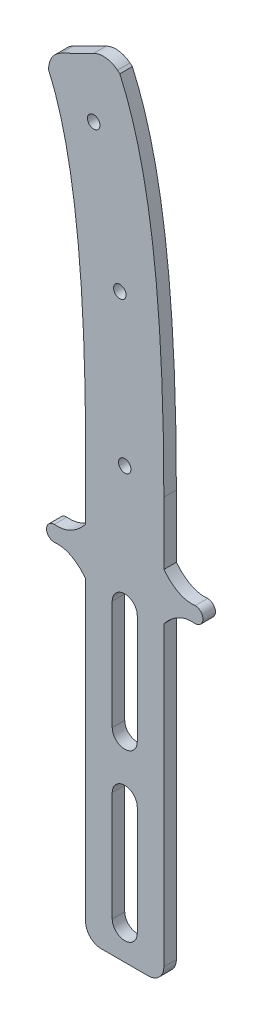
ISO-10303-21;
HEADER;
FILE_DESCRIPTION(('STEP AP214'),'2;1');
FILE_NAME('part.step','',(''),(''),'','','');
FILE_SCHEMA(('AUTOMOTIVE_DESIGN { 1 0 10303 214 1 1 1 1 }'));
ENDSEC;
DATA;
#1=APPLICATION_CONTEXT('core data for automotive mechanical design processes');
#2=APPLICATION_PROTOCOL_DEFINITION('international standard','automotive_design',2000,#1);
#3=PRODUCT_CONTEXT('',#1,'mechanical');
#4=PRODUCT('Part','Part','',(#3));
#5=PRODUCT_RELATED_PRODUCT_CATEGORY('part','',(#4));
#6=PRODUCT_DEFINITION_FORMATION('','',#4);
#7=PRODUCT_DEFINITION_CONTEXT('part definition',#1,'design');
#8=PRODUCT_DEFINITION('design','',#6,#7);
#9=PRODUCT_DEFINITION_SHAPE('','',#8);
#10=(LENGTH_UNIT() NAMED_UNIT(*) SI_UNIT(.MILLI.,.METRE.));
#11=(NAMED_UNIT(*) PLANE_ANGLE_UNIT() SI_UNIT($,.RADIAN.));
#12=(NAMED_UNIT(*) SI_UNIT($,.STERADIAN.) SOLID_ANGLE_UNIT());
#13=UNCERTAINTY_MEASURE_WITH_UNIT(LENGTH_MEASURE(1.E-05),#10,'distance_accuracy_value','');
#14=(GEOMETRIC_REPRESENTATION_CONTEXT(3) GLOBAL_UNCERTAINTY_ASSIGNED_CONTEXT((#13)) GLOBAL_UNIT_ASSIGNED_CONTEXT((#10,
#11,#12)) REPRESENTATION_CONTEXT('',''));
#15=CARTESIAN_POINT('',(0.,0.,0.));
#16=DIRECTION('',(0.,0.,1.));
#17=DIRECTION('',(1.,0.,0.));
#18=AXIS2_PLACEMENT_3D('',#15,#16,#17);
#19=CARTESIAN_POINT('',(12.4999999999998,78.,4.));
#20=DIRECTION('',(0.,0.,-1.));
#21=DIRECTION('',(-1.,0.,0.));
#22=AXIS2_PLACEMENT_3D('',#19,#20,#21);
#23=CYLINDRICAL_SURFACE('',#22,4.);
#24=CARTESIAN_POINT('',(12.4999999999998,78.,0.));
#25=DIRECTION('',(0.,0.,1.));
#26=DIRECTION('',(1.,0.,0.));
#27=AXIS2_PLACEMENT_3D('',#24,#25,#26);
#28=CIRCLE('',#27,4.);
#29=CARTESIAN_POINT('',(16.4999999999998,78.,0.));
#30=VERTEX_POINT('',#29);
#31=CARTESIAN_POINT('',(8.49999999999982,78.,0.));
#32=VERTEX_POINT('',#31);
#33=EDGE_CURVE('E398',#30,#32,#28,.T.);
#34=ORIENTED_EDGE('',*,*,#33,.F.);
#35=DIRECTION('',(0.,0.,-1.));
#36=VECTOR('',#35,1.);
#37=CARTESIAN_POINT('',(16.4999999999998,78.,4.));
#38=LINE('',#37,#36);
#39=CARTESIAN_POINT('',(16.4999999999998,78.,4.));
#40=VERTEX_POINT('',#39);
#41=EDGE_CURVE('E11',#40,#30,#38,.T.);
#42=ORIENTED_EDGE('',*,*,#41,.F.);
#43=CARTESIAN_POINT('',(12.4999999999998,78.,4.));
#44=DIRECTION('',(0.,0.,1.));
#45=DIRECTION('',(1.,0.,0.));
#46=AXIS2_PLACEMENT_3D('',#43,#44,#45);
#47=CIRCLE('',#46,4.);
#48=CARTESIAN_POINT('',(8.49999999999982,78.,4.));
#49=VERTEX_POINT('',#48);
#50=EDGE_CURVE('E254',#40,#49,#47,.T.);
#51=ORIENTED_EDGE('',*,*,#50,.T.);
#52=DIRECTION('',(0.,0.,-1.));
#53=VECTOR('',#52,1.);
#54=CARTESIAN_POINT('',(8.49999999999982,78.,4.));
#55=LINE('',#54,#53);
#56=EDGE_CURVE('E156',#49,#32,#55,.T.);
#57=ORIENTED_EDGE('',*,*,#56,.T.);
#58=EDGE_LOOP('',(#34,#42,#51,#57));
#59=FACE_BOUND('',#58,.T.);
#60=ADVANCED_FACE('F41',(#59),#23,.F.);
#61=CARTESIAN_POINT('',(16.4999999999998,0.,4.));
#62=DIRECTION('',(-1.,0.,0.));
#63=DIRECTION('',(0.,0.,1.));
#64=AXIS2_PLACEMENT_3D('',#61,#62,#63);
#65=PLANE('',#64);
#66=DIRECTION('',(0.,1.,0.));
#67=VECTOR('',#66,1.);
#68=CARTESIAN_POINT('',(16.4999999999998,0.,0.));
#69=LINE('',#68,#67);
#70=CARTESIAN_POINT('',(16.4999999999998,43.,0.));
#71=VERTEX_POINT('',#70);
#72=EDGE_CURVE('E244',#71,#30,#69,.T.);
#73=ORIENTED_EDGE('',*,*,#72,.F.);
#74=DIRECTION('',(0.,0.,-1.));
#75=VECTOR('',#74,1.);
#76=CARTESIAN_POINT('',(16.4999999999998,43.,4.));
#77=LINE('',#76,#75);
#78=CARTESIAN_POINT('',(16.4999999999998,43.,4.));
#79=VERTEX_POINT('',#78);
#80=EDGE_CURVE('E53',#79,#71,#77,.T.);
#81=ORIENTED_EDGE('',*,*,#80,.F.);
#82=DIRECTION('',(0.,1.,0.));
#83=VECTOR('',#82,1.);
#84=CARTESIAN_POINT('',(16.4999999999998,0.,4.));
#85=LINE('',#84,#83);
#86=EDGE_CURVE('E242',#79,#40,#85,.T.);
#87=ORIENTED_EDGE('',*,*,#86,.T.);
#88=ORIENTED_EDGE('',*,*,#41,.T.);
#89=EDGE_LOOP('',(#73,#81,#87,#88));
#90=FACE_BOUND('',#89,.T.);
#91=ADVANCED_FACE('F241',(#90),#65,.T.);
#92=CARTESIAN_POINT('',(12.4999999999998,43.,4.));
#93=DIRECTION('',(0.,0.,-1.));
#94=DIRECTION('',(-1.,0.,0.));
#95=AXIS2_PLACEMENT_3D('',#92,#93,#94);
#96=CYLINDRICAL_SURFACE('',#95,4.);
#97=CARTESIAN_POINT('',(12.4999999999998,43.,0.));
#98=DIRECTION('',(0.,0.,1.));
#99=DIRECTION('',(1.,0.,0.));
#100=AXIS2_PLACEMENT_3D('',#97,#98,#99);
#101=CIRCLE('',#100,4.);
#102=CARTESIAN_POINT('',(8.49999999999982,43.,0.));
#103=VERTEX_POINT('',#102);
#104=EDGE_CURVE('E404',#103,#71,#101,.T.);
#105=ORIENTED_EDGE('',*,*,#104,.F.);
#106=DIRECTION('',(0.,0.,-1.));
#107=VECTOR('',#106,1.);
#108=CARTESIAN_POINT('',(8.49999999999982,43.,4.));
#109=LINE('',#108,#107);
#110=CARTESIAN_POINT('',(8.49999999999982,43.,4.));
#111=VERTEX_POINT('',#110);
#112=EDGE_CURVE('E149',#111,#103,#109,.T.);
#113=ORIENTED_EDGE('',*,*,#112,.F.);
#114=CARTESIAN_POINT('',(12.4999999999998,43.,4.));
#115=DIRECTION('',(0.,0.,1.));
#116=DIRECTION('',(1.,0.,0.));
#117=AXIS2_PLACEMENT_3D('',#114,#115,#116);
#118=CIRCLE('',#117,4.);
#119=EDGE_CURVE('E253',#111,#79,#118,.T.);
#120=ORIENTED_EDGE('',*,*,#119,.T.);
#121=ORIENTED_EDGE('',*,*,#80,.T.);
#122=EDGE_LOOP('',(#105,#113,#120,#121));
#123=FACE_BOUND('',#122,.T.);
#124=ADVANCED_FACE('F257',(#123),#96,.F.);
#125=CARTESIAN_POINT('',(12.5,25.,4.));
#126=DIRECTION('',(0.,0.,-1.));
#127=DIRECTION('',(-1.,0.,0.));
#128=AXIS2_PLACEMENT_3D('',#125,#126,#127);
#129=CYLINDRICAL_SURFACE('',#128,4.);
#130=CARTESIAN_POINT('',(12.5,25.,0.));
#131=DIRECTION('',(0.,0.,1.));
#132=DIRECTION('',(1.,0.,0.));
#133=AXIS2_PLACEMENT_3D('',#130,#131,#132);
#134=CIRCLE('',#133,4.);
#135=CARTESIAN_POINT('',(16.5,25.,0.));
#136=VERTEX_POINT('',#135);
#137=CARTESIAN_POINT('',(8.5,25.,0.));
#138=VERTEX_POINT('',#137);
#139=EDGE_CURVE('E382',#136,#138,#134,.T.);
#140=ORIENTED_EDGE('',*,*,#139,.F.);
#141=DIRECTION('',(0.,0.,-1.));
#142=VECTOR('',#141,1.);
#143=CARTESIAN_POINT('',(16.5,25.,4.));
#144=LINE('',#143,#142);
#145=CARTESIAN_POINT('',(16.5,25.,4.));
#146=VERTEX_POINT('',#145);
#147=EDGE_CURVE('E425',#146,#136,#144,.T.);
#148=ORIENTED_EDGE('',*,*,#147,.F.);
#149=CARTESIAN_POINT('',(12.5,25.,4.));
#150=DIRECTION('',(0.,0.,1.));
#151=DIRECTION('',(1.,0.,0.));
#152=AXIS2_PLACEMENT_3D('',#149,#150,#151);
#153=CIRCLE('',#152,4.);
#154=CARTESIAN_POINT('',(8.5,25.,4.));
#155=VERTEX_POINT('',#154);
#156=EDGE_CURVE('E644',#146,#155,#153,.T.);
#157=ORIENTED_EDGE('',*,*,#156,.T.);
#158=DIRECTION('',(0.,0.,-1.));
#159=VECTOR('',#158,1.);
#160=CARTESIAN_POINT('',(8.5,25.,4.));
#161=LINE('',#160,#159);
#162=EDGE_CURVE('E428',#155,#138,#161,.T.);
#163=ORIENTED_EDGE('',*,*,#162,.T.);
#164=EDGE_LOOP('',(#140,#148,#157,#163));
#165=FACE_BOUND('',#164,.T.);
#166=ADVANCED_FACE('F611',(#165),#129,.F.);
#167=CARTESIAN_POINT('',(16.5,0.,4.));
#168=DIRECTION('',(-1.,0.,0.));
#169=DIRECTION('',(0.,0.,1.));
#170=AXIS2_PLACEMENT_3D('',#167,#168,#169);
#171=PLANE('',#170);
#172=DIRECTION('',(0.,1.,0.));
#173=VECTOR('',#172,1.);
#174=CARTESIAN_POINT('',(16.5,0.,0.));
#175=LINE('',#174,#173);
#176=CARTESIAN_POINT('',(16.5,-9.99999999999999,0.));
#177=VERTEX_POINT('',#176);
#178=EDGE_CURVE('E386',#177,#136,#175,.T.);
#179=ORIENTED_EDGE('',*,*,#178,.F.);
#180=DIRECTION('',(0.,0.,-1.));
#181=VECTOR('',#180,1.);
#182=CARTESIAN_POINT('',(16.5,-9.99999999999999,4.));
#183=LINE('',#182,#181);
#184=CARTESIAN_POINT('',(16.5,-9.99999999999999,4.));
#185=VERTEX_POINT('',#184);
#186=EDGE_CURVE('E434',#185,#177,#183,.T.);
#187=ORIENTED_EDGE('',*,*,#186,.F.);
#188=DIRECTION('',(0.,1.,0.));
#189=VECTOR('',#188,1.);
#190=CARTESIAN_POINT('',(16.5,0.,4.));
#191=LINE('',#190,#189);
#192=EDGE_CURVE('E648',#185,#146,#191,.T.);
#193=ORIENTED_EDGE('',*,*,#192,.T.);
#194=ORIENTED_EDGE('',*,*,#147,.T.);
#195=EDGE_LOOP('',(#179,#187,#193,#194));
#196=FACE_BOUND('',#195,.T.);
#197=ADVANCED_FACE('F607',(#196),#171,.T.);
#198=CARTESIAN_POINT('',(12.5,-9.99999999999999,4.));
#199=DIRECTION('',(0.,0.,-1.));
#200=DIRECTION('',(-1.,0.,0.));
#201=AXIS2_PLACEMENT_3D('',#198,#199,#200);
#202=CYLINDRICAL_SURFACE('',#201,4.);
#203=CARTESIAN_POINT('',(12.5,-9.99999999999999,0.));
#204=DIRECTION('',(0.,0.,1.));
#205=DIRECTION('',(1.,0.,0.));
#206=AXIS2_PLACEMENT_3D('',#203,#204,#205);
#207=CIRCLE('',#206,4.);
#208=CARTESIAN_POINT('',(8.5,-9.99999999999999,0.));
#209=VERTEX_POINT('',#208);
#210=EDGE_CURVE('E390',#209,#177,#207,.T.);
#211=ORIENTED_EDGE('',*,*,#210,.F.);
#212=DIRECTION('',(0.,0.,-1.));
#213=VECTOR('',#212,1.);
#214=CARTESIAN_POINT('',(8.5,-9.99999999999999,4.));
#215=LINE('',#214,#213);
#216=CARTESIAN_POINT('',(8.5,-9.99999999999999,4.));
#217=VERTEX_POINT('',#216);
#218=EDGE_CURVE('E431',#217,#209,#215,.T.);
#219=ORIENTED_EDGE('',*,*,#218,.F.);
#220=CARTESIAN_POINT('',(12.5,-9.99999999999999,4.));
#221=DIRECTION('',(0.,0.,1.));
#222=DIRECTION('',(1.,0.,0.));
#223=AXIS2_PLACEMENT_3D('',#220,#221,#222);
#224=CIRCLE('',#223,4.);
#225=EDGE_CURVE('E652',#217,#185,#224,.T.);
#226=ORIENTED_EDGE('',*,*,#225,.T.);
#227=ORIENTED_EDGE('',*,*,#186,.T.);
#228=EDGE_LOOP('',(#211,#219,#226,#227));
#229=FACE_BOUND('',#228,.T.);
#230=ADVANCED_FACE('F590',(#229),#202,.F.);
#231=CARTESIAN_POINT('',(0.,95.,4.));
#232=CARTESIAN_POINT('',(-4.58006982322337,89.4182050227499,4.));
#233=CARTESIAN_POINT('',(-10.,90.,4.));
#234=B_SPLINE_CURVE_WITH_KNOTS('',2,(#231,#232,#233),.UNSPECIFIED.,.F.,.F.,(3,3),(0.,1.),.UNSPECIFIED.);
#235=DIRECTION('',(0.,0.,-1.));
#236=VECTOR('',#235,1.);
#237=SURFACE_OF_LINEAR_EXTRUSION('',#234,#236);
#238=CARTESIAN_POINT('',(0.,95.,0.));
#239=CARTESIAN_POINT('',(-4.58006982322337,89.4182050227499,0.));
#240=CARTESIAN_POINT('',(-10.,90.,0.));
#241=B_SPLINE_CURVE_WITH_KNOTS('',2,(#238,#239,#240),.UNSPECIFIED.,.F.,.F.,(3,3),(0.,1.),.UNSPECIFIED.);
#242=CARTESIAN_POINT('',(0.,95.,0.));
#243=VERTEX_POINT('',#242);
#244=CARTESIAN_POINT('',(-10.,90.,0.));
#245=VERTEX_POINT('',#244);
#246=EDGE_CURVE('E277',#243,#245,#241,.T.);
#247=ORIENTED_EDGE('',*,*,#246,.T.);
#248=DIRECTION('',(0.,0.,-1.));
#249=VECTOR('',#248,1.);
#250=CARTESIAN_POINT('',(-10.,90.,4.));
#251=LINE('',#250,#249);
#252=CARTESIAN_POINT('',(-10.,90.,4.));
#253=VERTEX_POINT('',#252);
#254=EDGE_CURVE('E46',#253,#245,#251,.T.);
#255=ORIENTED_EDGE('',*,*,#254,.F.);
#256=CARTESIAN_POINT('',(0.,95.,4.));
#257=VERTEX_POINT('',#256);
#258=EDGE_CURVE('E422',#257,#253,#234,.T.);
#259=ORIENTED_EDGE('',*,*,#258,.F.);
#260=DIRECTION('',(0.,0.,-1.));
#261=VECTOR('',#260,1.);
#262=CARTESIAN_POINT('',(0.,95.,4.));
#263=LINE('',#262,#261);
#264=EDGE_CURVE('E276',#257,#243,#263,.T.);
#265=ORIENTED_EDGE('',*,*,#264,.T.);
#266=EDGE_LOOP('',(#247,#255,#259,#265));
#267=FACE_BOUND('',#266,.T.);
#268=ADVANCED_FACE('F43',(#267),#237,.F.);
#269=CARTESIAN_POINT('',(-10.,87.5,4.));
#270=DIRECTION('',(0.,0.,-1.));
#271=DIRECTION('',(-1.,0.,0.));
#272=AXIS2_PLACEMENT_3D('',#269,#270,#271);
#273=CYLINDRICAL_SURFACE('',#272,2.5);
#274=CARTESIAN_POINT('',(-10.,87.5,0.));
#275=DIRECTION('',(0.,0.,1.));
#276=DIRECTION('',(1.,0.,0.));
#277=AXIS2_PLACEMENT_3D('',#274,#275,#276);
#278=CIRCLE('',#277,2.5);
#279=CARTESIAN_POINT('',(-10.,85.,0.));
#280=VERTEX_POINT('',#279);
#281=EDGE_CURVE('E283',#245,#280,#278,.T.);
#282=ORIENTED_EDGE('',*,*,#281,.T.);
#283=DIRECTION('',(0.,0.,-1.));
#284=VECTOR('',#283,1.);
#285=CARTESIAN_POINT('',(-10.,85.,4.));
#286=LINE('',#285,#284);
#287=CARTESIAN_POINT('',(-10.,85.,4.));
#288=VERTEX_POINT('',#287);
#289=EDGE_CURVE('E496',#288,#280,#286,.T.);
#290=ORIENTED_EDGE('',*,*,#289,.F.);
#291=CARTESIAN_POINT('',(-10.,87.5,4.));
#292=DIRECTION('',(0.,0.,1.));
#293=DIRECTION('',(1.,0.,0.));
#294=AXIS2_PLACEMENT_3D('',#291,#292,#293);
#295=CIRCLE('',#294,2.5);
#296=EDGE_CURVE('E164',#253,#288,#295,.T.);
#297=ORIENTED_EDGE('',*,*,#296,.F.);
#298=ORIENTED_EDGE('',*,*,#254,.T.);
#299=EDGE_LOOP('',(#282,#290,#297,#298));
#300=FACE_BOUND('',#299,.T.);
#301=ADVANCED_FACE('F503',(#300),#273,.T.);
#302=CARTESIAN_POINT('',(0.,80.,4.));
#303=CARTESIAN_POINT('',(-4.58006982322337,85.5817949772501,4.));
#304=CARTESIAN_POINT('',(-10.,85.,4.));
#305=B_SPLINE_CURVE_WITH_KNOTS('',2,(#302,#303,#304),.UNSPECIFIED.,.F.,.F.,(3,3),(0.,1.),.UNSPECIFIED.);
#306=DIRECTION('',(0.,0.,-1.));
#307=VECTOR('',#306,1.);
#308=SURFACE_OF_LINEAR_EXTRUSION('',#305,#307);
#309=CARTESIAN_POINT('',(0.,80.,0.));
#310=CARTESIAN_POINT('',(-4.58006982322337,85.5817949772501,0.));
#311=CARTESIAN_POINT('',(-10.,85.,0.));
#312=B_SPLINE_CURVE_WITH_KNOTS('',2,(#309,#310,#311),.UNSPECIFIED.,.F.,.F.,(3,3),(0.,1.),.UNSPECIFIED.);
#313=CARTESIAN_POINT('',(0.,80.,0.));
#314=VERTEX_POINT('',#313);
#315=EDGE_CURVE('E290',#314,#280,#312,.T.);
#316=ORIENTED_EDGE('',*,*,#315,.F.);
#317=DIRECTION('',(0.,0.,-1.));
#318=VECTOR('',#317,1.);
#319=CARTESIAN_POINT('',(0.,80.,4.));
#320=LINE('',#319,#318);
#321=CARTESIAN_POINT('',(0.,80.,4.));
#322=VERTEX_POINT('',#321);
#323=EDGE_CURVE('E494',#322,#314,#320,.T.);
#324=ORIENTED_EDGE('',*,*,#323,.F.);
#325=EDGE_CURVE('E517',#322,#288,#305,.T.);
#326=ORIENTED_EDGE('',*,*,#325,.T.);
#327=ORIENTED_EDGE('',*,*,#289,.T.);
#328=EDGE_LOOP('',(#316,#324,#326,#327));
#329=FACE_BOUND('',#328,.T.);
#330=ADVANCED_FACE('F515',(#329),#308,.T.);
#331=CARTESIAN_POINT('',(0.,0.,4.));
#332=DIRECTION('',(-1.,0.,0.));
#333=DIRECTION('',(0.,0.,1.));
#334=AXIS2_PLACEMENT_3D('',#331,#332,#333);
#335=PLANE('',#334);
#336=DIRECTION('',(0.,1.,0.));
#337=VECTOR('',#336,1.);
#338=CARTESIAN_POINT('',(0.,0.,0.));
#339=LINE('',#338,#337);
#340=CARTESIAN_POINT('',(0.,-15.,0.));
#341=VERTEX_POINT('',#340);
#342=EDGE_CURVE('E296',#341,#314,#339,.T.);
#343=ORIENTED_EDGE('',*,*,#342,.F.);
#344=DIRECTION('',(0.,0.,-1.));
#345=VECTOR('',#344,1.);
#346=CARTESIAN_POINT('',(0.,-15.,4.));
#347=LINE('',#346,#345);
#348=CARTESIAN_POINT('',(0.,-15.,4.));
#349=VERTEX_POINT('',#348);
#350=EDGE_CURVE('E491',#349,#341,#347,.T.);
#351=ORIENTED_EDGE('',*,*,#350,.F.);
#352=DIRECTION('',(0.,1.,0.));
#353=VECTOR('',#352,1.);
#354=CARTESIAN_POINT('',(0.,0.,4.));
#355=LINE('',#354,#353);
#356=EDGE_CURVE('E523',#349,#322,#355,.T.);
#357=ORIENTED_EDGE('',*,*,#356,.T.);
#358=ORIENTED_EDGE('',*,*,#323,.T.);
#359=EDGE_LOOP('',(#343,#351,#357,#358));
#360=FACE_BOUND('',#359,.T.);
#361=ADVANCED_FACE('F526',(#360),#335,.T.);
#362=CARTESIAN_POINT('',(5.,-15.,4.));
#363=DIRECTION('',(0.,0.,-1.));
#364=DIRECTION('',(-1.,0.,0.));
#365=AXIS2_PLACEMENT_3D('',#362,#363,#364);
#366=CYLINDRICAL_SURFACE('',#365,5.);
#367=CARTESIAN_POINT('',(5.,-15.,0.));
#368=DIRECTION('',(0.,0.,1.));
#369=DIRECTION('',(1.,0.,0.));
#370=AXIS2_PLACEMENT_3D('',#367,#368,#369);
#371=CIRCLE('',#370,5.);
#372=CARTESIAN_POINT('',(5.00000000000004,-20.,0.));
#373=VERTEX_POINT('',#372);
#374=EDGE_CURVE('E303',#341,#373,#371,.T.);
#375=ORIENTED_EDGE('',*,*,#374,.T.);
#376=DIRECTION('',(0.,0.,-1.));
#377=VECTOR('',#376,1.);
#378=CARTESIAN_POINT('',(5.00000000000004,-20.,4.));
#379=LINE('',#378,#377);
#380=CARTESIAN_POINT('',(5.00000000000004,-20.,4.));
#381=VERTEX_POINT('',#380);
#382=EDGE_CURVE('E487',#381,#373,#379,.T.);
#383=ORIENTED_EDGE('',*,*,#382,.F.);
#384=CARTESIAN_POINT('',(5.,-15.,4.));
#385=DIRECTION('',(0.,0.,1.));
#386=DIRECTION('',(1.,0.,0.));
#387=AXIS2_PLACEMENT_3D('',#384,#385,#386);
#388=CIRCLE('',#387,5.);
#389=EDGE_CURVE('E529',#349,#381,#388,.T.);
#390=ORIENTED_EDGE('',*,*,#389,.F.);
#391=ORIENTED_EDGE('',*,*,#350,.T.);
#392=EDGE_LOOP('',(#375,#383,#390,#391));
#393=FACE_BOUND('',#392,.T.);
#394=ADVANCED_FACE('F578',(#393),#366,.T.);
#395=CARTESIAN_POINT('',(0.,-20.,4.));
#396=DIRECTION('',(0.,1.,0.));
#397=DIRECTION('',(0.,0.,1.));
#398=AXIS2_PLACEMENT_3D('',#395,#396,#397);
#399=PLANE('',#398);
#400=DIRECTION('',(1.,0.,0.));
#401=VECTOR('',#400,1.);
#402=CARTESIAN_POINT('',(0.,-20.,0.));
#403=LINE('',#402,#401);
#404=CARTESIAN_POINT('',(20.,-20.,0.));
#405=VERTEX_POINT('',#404);
#406=EDGE_CURVE('E306',#373,#405,#403,.T.);
#407=ORIENTED_EDGE('',*,*,#406,.T.);
#408=DIRECTION('',(0.,0.,-1.));
#409=VECTOR('',#408,1.);
#410=CARTESIAN_POINT('',(20.,-20.,4.));
#411=LINE('',#410,#409);
#412=CARTESIAN_POINT('',(20.,-20.,4.));
#413=VERTEX_POINT('',#412);
#414=EDGE_CURVE('E483',#413,#405,#411,.T.);
#415=ORIENTED_EDGE('',*,*,#414,.F.);
#416=DIRECTION('',(1.,0.,0.));
#417=VECTOR('',#416,1.);
#418=CARTESIAN_POINT('',(0.,-20.,4.));
#419=LINE('',#418,#417);
#420=EDGE_CURVE('E532',#381,#413,#419,.T.);
#421=ORIENTED_EDGE('',*,*,#420,.F.);
#422=ORIENTED_EDGE('',*,*,#382,.T.);
#423=EDGE_LOOP('',(#407,#415,#421,#422));
#424=FACE_BOUND('',#423,.T.);
#425=ADVANCED_FACE('F574',(#424),#399,.F.);
#426=CARTESIAN_POINT('',(20.,-15.,4.));
#427=DIRECTION('',(0.,0.,-1.));
#428=DIRECTION('',(-1.,0.,0.));
#429=AXIS2_PLACEMENT_3D('',#426,#427,#428);
#430=CYLINDRICAL_SURFACE('',#429,5.);
#431=CARTESIAN_POINT('',(20.,-15.,0.));
#432=DIRECTION('',(0.,0.,1.));
#433=DIRECTION('',(1.,0.,0.));
#434=AXIS2_PLACEMENT_3D('',#431,#432,#433);
#435=CIRCLE('',#434,5.);
#436=CARTESIAN_POINT('',(25.,-15.,0.));
#437=VERTEX_POINT('',#436);
#438=EDGE_CURVE('E309',#405,#437,#435,.T.);
#439=ORIENTED_EDGE('',*,*,#438,.T.);
#440=DIRECTION('',(0.,0.,-1.));
#441=VECTOR('',#440,1.);
#442=CARTESIAN_POINT('',(25.,-15.,4.));
#443=LINE('',#442,#441);
#444=CARTESIAN_POINT('',(25.,-15.,4.));
#445=VERTEX_POINT('',#444);
#446=EDGE_CURVE('E480',#445,#437,#443,.T.);
#447=ORIENTED_EDGE('',*,*,#446,.F.);
#448=CARTESIAN_POINT('',(20.,-15.,4.));
#449=DIRECTION('',(0.,0.,1.));
#450=DIRECTION('',(1.,0.,0.));
#451=AXIS2_PLACEMENT_3D('',#448,#449,#450);
#452=CIRCLE('',#451,5.);
#453=EDGE_CURVE('E541',#413,#445,#452,.T.);
#454=ORIENTED_EDGE('',*,*,#453,.F.);
#455=ORIENTED_EDGE('',*,*,#414,.T.);
#456=EDGE_LOOP('',(#439,#447,#454,#455));
#457=FACE_BOUND('',#456,.T.);
#458=ADVANCED_FACE('F570',(#457),#430,.T.);
#459=CARTESIAN_POINT('',(25.,0.,4.));
#460=DIRECTION('',(1.,0.,0.));
#461=DIRECTION('',(0.,1.,0.));
#462=AXIS2_PLACEMENT_3D('',#459,#460,#461);
#463=PLANE('',#462);
#464=DIRECTION('',(0.,-1.,0.));
#465=VECTOR('',#464,1.);
#466=CARTESIAN_POINT('',(25.,0.,0.));
#467=LINE('',#466,#465);
#468=CARTESIAN_POINT('',(25.,80.,0.));
#469=VERTEX_POINT('',#468);
#470=EDGE_CURVE('E313',#469,#437,#467,.T.);
#471=ORIENTED_EDGE('',*,*,#470,.F.);
#472=DIRECTION('',(0.,0.,-1.));
#473=VECTOR('',#472,1.);
#474=CARTESIAN_POINT('',(25.,80.,4.));
#475=LINE('',#474,#473);
#476=CARTESIAN_POINT('',(25.,80.,4.));
#477=VERTEX_POINT('',#476);
#478=EDGE_CURVE('E477',#477,#469,#475,.T.);
#479=ORIENTED_EDGE('',*,*,#478,.F.);
#480=DIRECTION('',(0.,-1.,0.));
#481=VECTOR('',#480,1.);
#482=CARTESIAN_POINT('',(25.,0.,4.));
#483=LINE('',#482,#481);
#484=EDGE_CURVE('E544',#477,#445,#483,.T.);
#485=ORIENTED_EDGE('',*,*,#484,.T.);
#486=ORIENTED_EDGE('',*,*,#446,.T.);
#487=EDGE_LOOP('',(#471,#479,#485,#486));
#488=FACE_BOUND('',#487,.T.);
#489=ADVANCED_FACE('F565',(#488),#463,.T.);
#490=CARTESIAN_POINT('',(25.,80.,4.));
#491=CARTESIAN_POINT('',(29.5800698232234,85.5817949772501,4.));
#492=CARTESIAN_POINT('',(35.,85.,4.));
#493=B_SPLINE_CURVE_WITH_KNOTS('',2,(#490,#491,#492),.UNSPECIFIED.,.F.,.F.,(3,3),(0.,1.),.UNSPECIFIED.);
#494=DIRECTION('',(0.,0.,-1.));
#495=VECTOR('',#494,1.);
#496=SURFACE_OF_LINEAR_EXTRUSION('',#493,#495);
#497=CARTESIAN_POINT('',(25.,80.,0.));
#498=CARTESIAN_POINT('',(29.5800698232234,85.5817949772501,0.));
#499=CARTESIAN_POINT('',(35.,85.,0.));
#500=B_SPLINE_CURVE_WITH_KNOTS('',2,(#497,#498,#499),.UNSPECIFIED.,.F.,.F.,(3,3),(0.,1.),.UNSPECIFIED.);
#501=CARTESIAN_POINT('',(35.,85.,0.));
#502=VERTEX_POINT('',#501);
#503=EDGE_CURVE('E317',#469,#502,#500,.T.);
#504=ORIENTED_EDGE('',*,*,#503,.T.);
#505=DIRECTION('',(0.,0.,-1.));
#506=VECTOR('',#505,1.);
#507=CARTESIAN_POINT('',(35.,85.,4.));
#508=LINE('',#507,#506);
#509=CARTESIAN_POINT('',(35.,85.,4.));
#510=VERTEX_POINT('',#509);
#511=EDGE_CURVE('E473',#510,#502,#508,.T.);
#512=ORIENTED_EDGE('',*,*,#511,.F.);
#513=EDGE_CURVE('E548',#477,#510,#493,.T.);
#514=ORIENTED_EDGE('',*,*,#513,.F.);
#515=ORIENTED_EDGE('',*,*,#478,.T.);
#516=EDGE_LOOP('',(#504,#512,#514,#515));
#517=FACE_BOUND('',#516,.T.);
#518=ADVANCED_FACE('F560',(#517),#496,.F.);
#519=CARTESIAN_POINT('',(35.,87.5,4.));
#520=DIRECTION('',(0.,0.,-1.));
#521=DIRECTION('',(-1.,0.,0.));
#522=AXIS2_PLACEMENT_3D('',#519,#520,#521);
#523=CYLINDRICAL_SURFACE('',#522,2.5);
#524=CARTESIAN_POINT('',(35.,87.5,0.));
#525=DIRECTION('',(0.,0.,1.));
#526=DIRECTION('',(1.,0.,0.));
#527=AXIS2_PLACEMENT_3D('',#524,#525,#526);
#528=CIRCLE('',#527,2.5);
#529=CARTESIAN_POINT('',(35.,90.,0.));
#530=VERTEX_POINT('',#529);
#531=EDGE_CURVE('E322',#502,#530,#528,.T.);
#532=ORIENTED_EDGE('',*,*,#531,.T.);
#533=DIRECTION('',(0.,0.,-1.));
#534=VECTOR('',#533,1.);
#535=CARTESIAN_POINT('',(35.,90.,4.));
#536=LINE('',#535,#534);
#537=CARTESIAN_POINT('',(35.,90.,4.));
#538=VERTEX_POINT('',#537);
#539=EDGE_CURVE('E470',#538,#530,#536,.T.);
#540=ORIENTED_EDGE('',*,*,#539,.F.);
#541=CARTESIAN_POINT('',(35.,87.5,4.));
#542=DIRECTION('',(0.,0.,1.));
#543=DIRECTION('',(1.,0.,0.));
#544=AXIS2_PLACEMENT_3D('',#541,#542,#543);
#545=CIRCLE('',#544,2.5);
#546=EDGE_CURVE('E554',#510,#538,#545,.T.);
#547=ORIENTED_EDGE('',*,*,#546,.F.);
#548=ORIENTED_EDGE('',*,*,#511,.T.);
#549=EDGE_LOOP('',(#532,#540,#547,#548));
#550=FACE_BOUND('',#549,.T.);
#551=ADVANCED_FACE('F564',(#550),#523,.T.);
#552=CARTESIAN_POINT('',(25.,95.,4.));
#553=CARTESIAN_POINT('',(29.5800698232234,89.4182050227499,4.));
#554=CARTESIAN_POINT('',(35.,90.,4.));
#555=B_SPLINE_CURVE_WITH_KNOTS('',2,(#552,#553,#554),.UNSPECIFIED.,.F.,.F.,(3,3),(0.,1.),.UNSPECIFIED.);
#556=DIRECTION('',(0.,0.,-1.));
#557=VECTOR('',#556,1.);
#558=SURFACE_OF_LINEAR_EXTRUSION('',#555,#557);
#559=CARTESIAN_POINT('',(25.,95.,0.));
#560=CARTESIAN_POINT('',(29.5800698232234,89.4182050227499,0.));
#561=CARTESIAN_POINT('',(35.,90.,0.));
#562=B_SPLINE_CURVE_WITH_KNOTS('',2,(#559,#560,#561),.UNSPECIFIED.,.F.,.F.,(3,3),(0.,1.),.UNSPECIFIED.);
#563=CARTESIAN_POINT('',(25.,95.,0.));
#564=VERTEX_POINT('',#563);
#565=EDGE_CURVE('E329',#564,#530,#562,.T.);
#566=ORIENTED_EDGE('',*,*,#565,.F.);
#567=DIRECTION('',(0.,0.,-1.));
#568=VECTOR('',#567,1.);
#569=CARTESIAN_POINT('',(25.,95.,4.));
#570=LINE('',#569,#568);
#571=CARTESIAN_POINT('',(25.,95.,4.));
#572=VERTEX_POINT('',#571);
#573=EDGE_CURVE('E467',#572,#564,#570,.T.);
#574=ORIENTED_EDGE('',*,*,#573,.F.);
#575=EDGE_CURVE('E933',#572,#538,#555,.T.);
#576=ORIENTED_EDGE('',*,*,#575,.T.);
#577=ORIENTED_EDGE('',*,*,#539,.T.);
#578=EDGE_LOOP('',(#566,#574,#576,#577));
#579=FACE_BOUND('',#578,.T.);
#580=ADVANCED_FACE('F747',(#579),#558,.T.);
#581=CARTESIAN_POINT('',(25.,0.,4.));
#582=DIRECTION('',(1.,0.,0.));
#583=DIRECTION('',(0.,0.,-1.));
#584=AXIS2_PLACEMENT_3D('',#581,#582,#583);
#585=PLANE('',#584);
#586=DIRECTION('',(0.,-1.,0.));
#587=VECTOR('',#586,1.);
#588=CARTESIAN_POINT('',(25.,0.,0.));
#589=LINE('',#588,#587);
#590=CARTESIAN_POINT('',(25.,115.,0.));
#591=VERTEX_POINT('',#590);
#592=EDGE_CURVE('E335',#591,#564,#589,.T.);
#593=ORIENTED_EDGE('',*,*,#592,.F.);
#594=DIRECTION('',(0.,0.,-1.));
#595=VECTOR('',#594,1.);
#596=CARTESIAN_POINT('',(25.,115.,4.));
#597=LINE('',#596,#595);
#598=CARTESIAN_POINT('',(25.,115.,4.));
#599=VERTEX_POINT('',#598);
#600=EDGE_CURVE('E464',#599,#591,#597,.T.);
#601=ORIENTED_EDGE('',*,*,#600,.F.);
#602=DIRECTION('',(0.,-1.,0.));
#603=VECTOR('',#602,1.);
#604=CARTESIAN_POINT('',(25.,0.,4.));
#605=LINE('',#604,#603);
#606=EDGE_CURVE('E929',#599,#572,#605,.T.);
#607=ORIENTED_EDGE('',*,*,#606,.T.);
#608=ORIENTED_EDGE('',*,*,#573,.T.);
#609=EDGE_LOOP('',(#593,#601,#607,#608));
#610=FACE_BOUND('',#609,.T.);
#611=ADVANCED_FACE('F756',(#610),#585,.T.);
#612=CARTESIAN_POINT('',(25.,115.,4.));
#613=CARTESIAN_POINT('',(25.0012048224569,129.211053509505,4.));
#614=CARTESIAN_POINT('',(24.1377873514335,154.495125378925,4.));
#615=CARTESIAN_POINT('',(22.3804627742528,176.729339584373,4.));
#616=CARTESIAN_POINT('',(20.0942771087378,192.884242442991,4.));
#617=CARTESIAN_POINT('',(17.7647484623135,204.645244522672,4.));
#618=CARTESIAN_POINT('',(15.1936232897448,214.033612370515,4.));
#619=CARTESIAN_POINT('',(12.5414191425901,221.593812890793,4.));
#620=CARTESIAN_POINT('',(10.9244037242233,225.168293258689,4.));
#621=B_SPLINE_CURVE_WITH_KNOTS('',2,(#612,#613,#614,#615,#616,#617,#618,#619,#620),
.UNSPECIFIED.,.F.,.F.,(3,1,1,1,1,1,1,3),(0.,0.1875,0.375,0.5625,0.6875,0.8125,0.90625,1.),.UNSPECIFIED.);
#622=DIRECTION('',(0.,0.,-1.));
#623=VECTOR('',#622,1.);
#624=SURFACE_OF_LINEAR_EXTRUSION('',#621,#623);
#625=CARTESIAN_POINT('',(25.,115.,0.));
#626=CARTESIAN_POINT('',(25.0012048224569,129.211053509505,0.));
#627=CARTESIAN_POINT('',(24.1377873514335,154.495125378925,0.));
#628=CARTESIAN_POINT('',(22.3804627742528,176.729339584373,0.));
#629=CARTESIAN_POINT('',(20.0942771087378,192.884242442991,0.));
#630=CARTESIAN_POINT('',(17.7647484623135,204.645244522672,0.));
#631=CARTESIAN_POINT('',(15.1936232897448,214.033612370515,0.));
#632=CARTESIAN_POINT('',(12.5414191425901,221.593812890793,0.));
#633=CARTESIAN_POINT('',(10.9244037242233,225.168293258689,0.));
#634=B_SPLINE_CURVE_WITH_KNOTS('',2,(#625,#626,#627,#628,#629,#630,#631,#632,#633),
.UNSPECIFIED.,.F.,.F.,(3,1,1,1,1,1,1,3),(0.,0.1875,0.375,0.5625,0.6875,0.8125,0.90625,1.),.UNSPECIFIED.);
#635=CARTESIAN_POINT('',(10.9244037242233,225.168293258689,0.));
#636=VERTEX_POINT('',#635);
#637=EDGE_CURVE('E342',#591,#636,#634,.T.);
#638=ORIENTED_EDGE('',*,*,#637,.T.);
#639=DIRECTION('',(0.,0.,-1.));
#640=VECTOR('',#639,1.);
#641=CARTESIAN_POINT('',(10.9244037242233,225.168293258689,4.));
#642=LINE('',#641,#640);
#643=CARTESIAN_POINT('',(10.9244037242233,225.168293258689,4.));
#644=VERTEX_POINT('',#643);
#645=EDGE_CURVE('E461',#644,#636,#642,.T.);
#646=ORIENTED_EDGE('',*,*,#645,.F.);
#647=EDGE_CURVE('E923',#599,#644,#621,.T.);
#648=ORIENTED_EDGE('',*,*,#647,.F.);
#649=ORIENTED_EDGE('',*,*,#600,.T.);
#650=EDGE_LOOP('',(#638,#646,#648,#649));
#651=FACE_BOUND('',#650,.T.);
#652=ADVANCED_FACE('F766',(#651),#624,.F.);
#653=CARTESIAN_POINT('',(115.162489269794,138.485356332989,4.));
#654=DIRECTION('',(0.639391196733159,0.768881588763926,0.));
#655=DIRECTION('',(-0.768881588763926,0.639391196733159,0.));
#656=AXIS2_PLACEMENT_3D('',#653,#654,#655);
#657=PLANE('',#656);
#658=DIRECTION('',(0.768881588763926,-0.639391196733159,0.));
#659=VECTOR('',#658,1.);
#660=CARTESIAN_POINT('',(115.162489269794,138.485356332989,0.));
#661=LINE('',#660,#659);
#662=CARTESIAN_POINT('',(10.1763371165527,225.790375007692,0.));
#663=VERTEX_POINT('',#662);
#664=EDGE_CURVE('E348',#663,#636,#661,.T.);
#665=ORIENTED_EDGE('',*,*,#664,.F.);
#666=DIRECTION('',(0.,0.,-1.));
#667=VECTOR('',#666,1.);
#668=CARTESIAN_POINT('',(10.1763371165527,225.790375007692,4.));
#669=LINE('',#668,#667);
#670=CARTESIAN_POINT('',(10.1763371165527,225.790375007692,4.));
#671=VERTEX_POINT('',#670);
#672=EDGE_CURVE('E458',#671,#663,#669,.T.);
#673=ORIENTED_EDGE('',*,*,#672,.F.);
#674=DIRECTION('',(0.768881588763926,-0.639391196733159,0.));
#675=VECTOR('',#674,1.);
#676=CARTESIAN_POINT('',(115.162489269794,138.485356332989,4.));
#677=LINE('',#676,#675);
#678=EDGE_CURVE('E919',#671,#644,#677,.T.);
#679=ORIENTED_EDGE('',*,*,#678,.T.);
#680=ORIENTED_EDGE('',*,*,#645,.T.);
#681=EDGE_LOOP('',(#665,#673,#679,#680));
#682=FACE_BOUND('',#681,.T.);
#683=ADVANCED_FACE('F776',(#682),#657,.T.);
#684=CARTESIAN_POINT('',(5.70059873942051,220.408203886345,4.));
#685=DIRECTION('',(0.,0.,-1.));
#686=DIRECTION('',(-1.,0.,0.));
#687=AXIS2_PLACEMENT_3D('',#684,#685,#686);
#688=CYLINDRICAL_SURFACE('',#687,7.00000000000001);
#689=CARTESIAN_POINT('',(5.70059873942051,220.408203886345,0.));
#690=DIRECTION('',(0.,0.,1.));
#691=DIRECTION('',(1.,0.,0.));
#692=AXIS2_PLACEMENT_3D('',#689,#690,#691);
#693=CIRCLE('',#692,7.00000000000001);
#694=CARTESIAN_POINT('',(2.58180780478298,226.675032678168,0.));
#695=VERTEX_POINT('',#694);
#696=EDGE_CURVE('E355',#695,#663,#693,.F.);
#697=ORIENTED_EDGE('',*,*,#696,.F.);
#698=DIRECTION('',(0.,0.,-1.));
#699=VECTOR('',#698,1.);
#700=CARTESIAN_POINT('',(2.58180780478298,226.675032678168,4.));
#701=LINE('',#700,#699);
#702=CARTESIAN_POINT('',(2.58180780478298,226.675032678168,4.));
#703=VERTEX_POINT('',#702);
#704=EDGE_CURVE('E455',#703,#695,#701,.T.);
#705=ORIENTED_EDGE('',*,*,#704,.F.);
#706=CARTESIAN_POINT('',(5.70059873942051,220.408203886345,4.));
#707=DIRECTION('',(0.,0.,1.));
#708=DIRECTION('',(1.,0.,0.));
#709=AXIS2_PLACEMENT_3D('',#706,#707,#708);
#710=CIRCLE('',#709,7.00000000000001);
#711=EDGE_CURVE('E913',#703,#671,#710,.F.);
#712=ORIENTED_EDGE('',*,*,#711,.T.);
#713=ORIENTED_EDGE('',*,*,#672,.T.);
#714=EDGE_LOOP('',(#697,#705,#712,#713));
#715=FACE_BOUND('',#714,.T.);
#716=ADVANCED_FACE('F786',(#715),#688,.T.);
#717=CARTESIAN_POINT('',(-89.9027450004782,180.64856626833,4.));
#718=DIRECTION('',(-0.445541562091071,0.895261255974729,0.));
#719=DIRECTION('',(-0.895261255974729,-0.445541562091071,0.));
#720=AXIS2_PLACEMENT_3D('',#717,#718,#719);
#721=PLANE('',#720);
#722=DIRECTION('',(0.895261255974729,0.445541562091071,0.));
#723=VECTOR('',#722,1.);
#724=CARTESIAN_POINT('',(-89.9027450004782,180.64856626833,0.));
#725=LINE('',#724,#723);
#726=CARTESIAN_POINT('',(-7.94987048868415,221.433768893997,0.));
#727=VERTEX_POINT('',#726);
#728=EDGE_CURVE('E359',#727,#695,#725,.T.);
#729=ORIENTED_EDGE('',*,*,#728,.F.);
#730=DIRECTION('',(0.,0.,-1.));
#731=VECTOR('',#730,1.);
#732=CARTESIAN_POINT('',(-7.94987048868415,221.433768893997,4.));
#733=LINE('',#732,#731);
#734=CARTESIAN_POINT('',(-7.94987048868415,221.433768893997,4.));
#735=VERTEX_POINT('',#734);
#736=EDGE_CURVE('E452',#735,#727,#733,.T.);
#737=ORIENTED_EDGE('',*,*,#736,.F.);
#738=DIRECTION('',(0.895261255974729,0.445541562091071,0.));
#739=VECTOR('',#738,1.);
#740=CARTESIAN_POINT('',(-89.9027450004782,180.64856626833,4.));
#741=LINE('',#740,#739);
#742=EDGE_CURVE('E910',#735,#703,#741,.T.);
#743=ORIENTED_EDGE('',*,*,#742,.T.);
#744=ORIENTED_EDGE('',*,*,#704,.T.);
#745=EDGE_LOOP('',(#729,#737,#743,#744));
#746=FACE_BOUND('',#745,.T.);
#747=ADVANCED_FACE('F796',(#746),#721,.T.);
#748=CARTESIAN_POINT('',(-4.83107955404668,215.166940102173,4.));
#749=DIRECTION('',(0.,0.,-1.));
#750=DIRECTION('',(-1.,0.,0.));
#751=AXIS2_PLACEMENT_3D('',#748,#749,#750);
#752=CYLINDRICAL_SURFACE('',#751,7.);
#753=CARTESIAN_POINT('',(-4.83107955404668,215.166940102173,0.));
#754=DIRECTION('',(0.,0.,1.));
#755=DIRECTION('',(1.,0.,0.));
#756=AXIS2_PLACEMENT_3D('',#753,#754,#755);
#757=CIRCLE('',#756,7.);
#758=CARTESIAN_POINT('',(-11.8310795540467,215.166940102173,0.));
#759=VERTEX_POINT('',#758);
#760=EDGE_CURVE('E363',#727,#759,#757,.T.);
#761=ORIENTED_EDGE('',*,*,#760,.T.);
#762=DIRECTION('',(0.,0.,-1.));
#763=VECTOR('',#762,1.);
#764=CARTESIAN_POINT('',(-11.8310795540467,215.166940102173,4.));
#765=LINE('',#764,#763);
#766=CARTESIAN_POINT('',(-11.8310795540467,215.166940102173,4.));
#767=VERTEX_POINT('',#766);
#768=EDGE_CURVE('E448',#767,#759,#765,.T.);
#769=ORIENTED_EDGE('',*,*,#768,.F.);
#770=CARTESIAN_POINT('',(-4.83107955404668,215.166940102173,4.));
#771=DIRECTION('',(0.,0.,1.));
#772=DIRECTION('',(1.,0.,0.));
#773=AXIS2_PLACEMENT_3D('',#770,#771,#772);
#774=CIRCLE('',#773,7.);
#775=EDGE_CURVE('E907',#735,#767,#774,.T.);
#776=ORIENTED_EDGE('',*,*,#775,.F.);
#777=ORIENTED_EDGE('',*,*,#736,.T.);
#778=EDGE_LOOP('',(#761,#769,#776,#777));
#779=FACE_BOUND('',#778,.T.);
#780=ADVANCED_FACE('F806',(#779),#752,.T.);
#781=CARTESIAN_POINT('',(-11.8310795540467,0.,4.));
#782=DIRECTION('',(1.,0.,0.));
#783=DIRECTION('',(0.,0.,-1.));
#784=AXIS2_PLACEMENT_3D('',#781,#782,#783);
#785=PLANE('',#784);
#786=DIRECTION('',(0.,-1.,0.));
#787=VECTOR('',#786,1.);
#788=CARTESIAN_POINT('',(-11.8310795540467,0.,0.));
#789=LINE('',#788,#787);
#790=CARTESIAN_POINT('',(-11.8310795540467,214.815130419615,0.));
#791=VERTEX_POINT('',#790);
#792=EDGE_CURVE('E366',#759,#791,#789,.T.);
#793=ORIENTED_EDGE('',*,*,#792,.T.);
#794=DIRECTION('',(0.,0.,-1.));
#795=VECTOR('',#794,1.);
#796=CARTESIAN_POINT('',(-11.8310795540467,214.815130419615,4.));
#797=LINE('',#796,#795);
#798=CARTESIAN_POINT('',(-11.8310795540467,214.815130419615,4.));
#799=VERTEX_POINT('',#798);
#800=EDGE_CURVE('E445',#799,#791,#797,.T.);
#801=ORIENTED_EDGE('',*,*,#800,.F.);
#802=DIRECTION('',(0.,-1.,0.));
#803=VECTOR('',#802,1.);
#804=CARTESIAN_POINT('',(-11.8310795540467,0.,4.));
#805=LINE('',#804,#803);
#806=EDGE_CURVE('E637',#767,#799,#805,.T.);
#807=ORIENTED_EDGE('',*,*,#806,.F.);
#808=ORIENTED_EDGE('',*,*,#768,.T.);
#809=EDGE_LOOP('',(#793,#801,#807,#808));
#810=FACE_BOUND('',#809,.T.);
#811=ADVANCED_FACE('F625',(#810),#785,.F.);
#812=CARTESIAN_POINT('',(0.,115.,4.));
#813=CARTESIAN_POINT('',(0.,188.811295925684,4.));
#814=CARTESIAN_POINT('',(-11.8310795540467,214.815130419615,4.));
#815=B_SPLINE_CURVE_WITH_KNOTS('',2,(#812,#813,#814),.UNSPECIFIED.,.F.,.F.,(3,3),(0.,1.),.UNSPECIFIED.);
#816=DIRECTION('',(0.,0.,-1.));
#817=VECTOR('',#816,1.);
#818=SURFACE_OF_LINEAR_EXTRUSION('',#815,#817);
#819=CARTESIAN_POINT('',(0.,115.,0.));
#820=CARTESIAN_POINT('',(0.,188.811295925684,0.));
#821=CARTESIAN_POINT('',(-11.8310795540467,214.815130419615,0.));
#822=B_SPLINE_CURVE_WITH_KNOTS('',2,(#819,#820,#821),.UNSPECIFIED.,.F.,.F.,(3,3),(0.,1.),.UNSPECIFIED.);
#823=CARTESIAN_POINT('',(0.,115.,0.));
#824=VERTEX_POINT('',#823);
#825=EDGE_CURVE('E370',#824,#791,#822,.T.);
#826=ORIENTED_EDGE('',*,*,#825,.F.);
#827=DIRECTION('',(0.,0.,-1.));
#828=VECTOR('',#827,1.);
#829=CARTESIAN_POINT('',(0.,115.,4.));
#830=LINE('',#829,#828);
#831=CARTESIAN_POINT('',(0.,115.,4.));
#832=VERTEX_POINT('',#831);
#833=EDGE_CURVE('E442',#832,#824,#830,.T.);
#834=ORIENTED_EDGE('',*,*,#833,.F.);
#835=EDGE_CURVE('E628',#832,#799,#815,.T.);
#836=ORIENTED_EDGE('',*,*,#835,.T.);
#837=ORIENTED_EDGE('',*,*,#800,.T.);
#838=EDGE_LOOP('',(#826,#834,#836,#837));
#839=FACE_BOUND('',#838,.T.);
#840=ADVANCED_FACE('F620',(#839),#818,.T.);
#841=CARTESIAN_POINT('',(10.9244037242233,164.911196929082,4.));
#842=DIRECTION('',(0.,0.,-1.));
#843=DIRECTION('',(-1.,0.,0.));
#844=AXIS2_PLACEMENT_3D('',#841,#842,#843);
#845=CYLINDRICAL_SURFACE('',#844,2.);
#846=CARTESIAN_POINT('',(10.9244037242233,164.911196929082,4.));
#847=DIRECTION('',(0.,0.,1.));
#848=DIRECTION('',(1.,0.,0.));
#849=AXIS2_PLACEMENT_3D('',#846,#847,#848);
#850=CIRCLE('',#849,2.);
#851=CARTESIAN_POINT('',(12.9244037242233,164.911196929082,4.));
#852=VERTEX_POINT('',#851);
#853=EDGE_CURVE('E268',#852,#852,#850,.T.);
#854=ORIENTED_EDGE('',*,*,#853,.T.);
#855=EDGE_LOOP('',(#854));
#856=FACE_BOUND('',#855,.T.);
#857=CARTESIAN_POINT('',(10.9244037242233,164.911196929082,0.));
#858=DIRECTION('',(0.,0.,1.));
#859=DIRECTION('',(1.,0.,0.));
#860=AXIS2_PLACEMENT_3D('',#857,#858,#859);
#861=CIRCLE('',#860,2.);
#862=CARTESIAN_POINT('',(12.9244037242233,164.911196929082,0.));
#863=VERTEX_POINT('',#862);
#864=EDGE_CURVE('E414',#863,#863,#861,.T.);
#865=ORIENTED_EDGE('',*,*,#864,.F.);
#866=EDGE_LOOP('',(#865));
#867=FACE_BOUND('',#866,.T.);
#868=ADVANCED_FACE('F624',(#856,#867),#845,.F.);
#869=CARTESIAN_POINT('',(2.58180780478299,207.705811606366,4.));
#870=DIRECTION('',(0.,0.,-1.));
#871=DIRECTION('',(-1.,0.,0.));
#872=AXIS2_PLACEMENT_3D('',#869,#870,#871);
#873=CYLINDRICAL_SURFACE('',#872,2.);
#874=CARTESIAN_POINT('',(2.58180780478299,207.705811606366,4.));
#875=DIRECTION('',(0.,0.,1.));
#876=DIRECTION('',(1.,0.,0.));
#877=AXIS2_PLACEMENT_3D('',#874,#875,#876);
#878=CIRCLE('',#877,2.);
#879=CARTESIAN_POINT('',(4.58180780478299,207.705811606366,4.));
#880=VERTEX_POINT('',#879);
#881=EDGE_CURVE('E261',#880,#880,#878,.T.);
#882=ORIENTED_EDGE('',*,*,#881,.T.);
#883=EDGE_LOOP('',(#882));
#884=FACE_BOUND('',#883,.T.);
#885=CARTESIAN_POINT('',(2.58180780478299,207.705811606366,0.));
#886=DIRECTION('',(0.,0.,1.));
#887=DIRECTION('',(1.,0.,0.));
#888=AXIS2_PLACEMENT_3D('',#885,#886,#887);
#889=CIRCLE('',#888,2.);
#890=CARTESIAN_POINT('',(4.58180780478299,207.705811606366,0.));
#891=VERTEX_POINT('',#890);
#892=EDGE_CURVE('E410',#891,#891,#889,.T.);
#893=ORIENTED_EDGE('',*,*,#892,.F.);
#894=EDGE_LOOP('',(#893));
#895=FACE_BOUND('',#894,.T.);
#896=ADVANCED_FACE('F662',(#884,#895),#873,.F.);
#897=CARTESIAN_POINT('',(8.49999999999982,0.,4.));
#898=DIRECTION('',(-1.,0.,0.));
#899=DIRECTION('',(0.,0.,1.));
#900=AXIS2_PLACEMENT_3D('',#897,#898,#899);
#901=PLANE('',#900);
#902=DIRECTION('',(0.,1.,0.));
#903=VECTOR('',#902,1.);
#904=CARTESIAN_POINT('',(8.49999999999982,0.,0.));
#905=LINE('',#904,#903);
#906=EDGE_CURVE('E407',#103,#32,#905,.T.);
#907=ORIENTED_EDGE('',*,*,#906,.T.);
#908=ORIENTED_EDGE('',*,*,#56,.F.);
#909=DIRECTION('',(0.,1.,0.));
#910=VECTOR('',#909,1.);
#911=CARTESIAN_POINT('',(8.49999999999982,0.,4.));
#912=LINE('',#911,#910);
#913=EDGE_CURVE('E62',#111,#49,#912,.T.);
#914=ORIENTED_EDGE('',*,*,#913,.F.);
#915=ORIENTED_EDGE('',*,*,#112,.T.);
#916=EDGE_LOOP('',(#907,#908,#914,#915));
#917=FACE_BOUND('',#916,.T.);
#918=ADVANCED_FACE('F603',(#917),#901,.F.);
#919=CARTESIAN_POINT('',(8.5,0.,4.));
#920=DIRECTION('',(-1.,0.,0.));
#921=DIRECTION('',(0.,0.,1.));
#922=AXIS2_PLACEMENT_3D('',#919,#920,#921);
#923=PLANE('',#922);
#924=DIRECTION('',(0.,1.,0.));
#925=VECTOR('',#924,1.);
#926=CARTESIAN_POINT('',(8.5,0.,0.));
#927=LINE('',#926,#925);
#928=EDGE_CURVE('E394',#209,#138,#927,.T.);
#929=ORIENTED_EDGE('',*,*,#928,.T.);
#930=ORIENTED_EDGE('',*,*,#162,.F.);
#931=DIRECTION('',(0.,1.,0.));
#932=VECTOR('',#931,1.);
#933=CARTESIAN_POINT('',(8.5,0.,4.));
#934=LINE('',#933,#932);
#935=EDGE_CURVE('E656',#217,#155,#934,.T.);
#936=ORIENTED_EDGE('',*,*,#935,.F.);
#937=ORIENTED_EDGE('',*,*,#218,.T.);
#938=EDGE_LOOP('',(#929,#930,#936,#937));
#939=FACE_BOUND('',#938,.T.);
#940=ADVANCED_FACE('F599',(#939),#923,.F.);
#941=CARTESIAN_POINT('',(0.,0.,4.));
#942=DIRECTION('',(1.,0.,0.));
#943=DIRECTION('',(0.,0.,-1.));
#944=AXIS2_PLACEMENT_3D('',#941,#942,#943);
#945=PLANE('',#944);
#946=DIRECTION('',(0.,-1.,0.));
#947=VECTOR('',#946,1.);
#948=CARTESIAN_POINT('',(0.,0.,0.));
#949=LINE('',#948,#947);
#950=EDGE_CURVE('E376',#824,#243,#949,.T.);
#951=ORIENTED_EDGE('',*,*,#950,.T.);
#952=ORIENTED_EDGE('',*,*,#264,.F.);
#953=DIRECTION('',(0.,-1.,0.));
#954=VECTOR('',#953,1.);
#955=CARTESIAN_POINT('',(0.,0.,4.));
#956=LINE('',#955,#954);
#957=EDGE_CURVE('E636',#832,#257,#956,.T.);
#958=ORIENTED_EDGE('',*,*,#957,.F.);
#959=ORIENTED_EDGE('',*,*,#833,.T.);
#960=EDGE_LOOP('',(#951,#952,#958,#959));
#961=FACE_BOUND('',#960,.T.);
#962=ADVANCED_FACE('F602',(#961),#945,.F.);
#963=CARTESIAN_POINT('',(12.4999999999998,117.457765325466,4.));
#964=DIRECTION('',(0.,0.,-1.));
#965=DIRECTION('',(-1.,0.,0.));
#966=AXIS2_PLACEMENT_3D('',#963,#964,#965);
#967=CYLINDRICAL_SURFACE('',#966,2.);
#968=CARTESIAN_POINT('',(12.4999999999998,117.457765325466,4.));
#969=DIRECTION('',(0.,0.,1.));
#970=DIRECTION('',(1.,0.,0.));
#971=AXIS2_PLACEMENT_3D('',#968,#969,#970);
#972=CIRCLE('',#971,2.);
#973=CARTESIAN_POINT('',(14.4999999999998,117.457765325466,4.));
#974=VERTEX_POINT('',#973);
#975=EDGE_CURVE('E272',#974,#974,#972,.T.);
#976=ORIENTED_EDGE('',*,*,#975,.T.);
#977=EDGE_LOOP('',(#976));
#978=FACE_BOUND('',#977,.T.);
#979=CARTESIAN_POINT('',(12.4999999999998,117.457765325466,0.));
#980=DIRECTION('',(0.,0.,1.));
#981=DIRECTION('',(1.,0.,0.));
#982=AXIS2_PLACEMENT_3D('',#979,#980,#981);
#983=CIRCLE('',#982,2.);
#984=CARTESIAN_POINT('',(14.4999999999998,117.457765325466,0.));
#985=VERTEX_POINT('',#984);
#986=EDGE_CURVE('E418',#985,#985,#983,.T.);
#987=ORIENTED_EDGE('',*,*,#986,.F.);
#988=EDGE_LOOP('',(#987));
#989=FACE_BOUND('',#988,.T.);
#990=ADVANCED_FACE('F618',(#978,#989),#967,.F.);
#991=CARTESIAN_POINT('',(0.,0.,4.));
#992=DIRECTION('',(0.,0.,1.));
#993=DIRECTION('',(1.,0.,0.));
#994=AXIS2_PLACEMENT_3D('',#991,#992,#993);
#995=PLANE('',#994);
#996=ORIENTED_EDGE('',*,*,#258,.T.);
#997=ORIENTED_EDGE('',*,*,#296,.T.);
#998=ORIENTED_EDGE('',*,*,#325,.F.);
#999=ORIENTED_EDGE('',*,*,#356,.F.);
#1000=ORIENTED_EDGE('',*,*,#389,.T.);
#1001=ORIENTED_EDGE('',*,*,#420,.T.);
#1002=ORIENTED_EDGE('',*,*,#453,.T.);
#1003=ORIENTED_EDGE('',*,*,#484,.F.);
#1004=ORIENTED_EDGE('',*,*,#513,.T.);
#1005=ORIENTED_EDGE('',*,*,#546,.T.);
#1006=ORIENTED_EDGE('',*,*,#575,.F.);
#1007=ORIENTED_EDGE('',*,*,#606,.F.);
#1008=ORIENTED_EDGE('',*,*,#647,.T.);
#1009=ORIENTED_EDGE('',*,*,#678,.F.);
#1010=ORIENTED_EDGE('',*,*,#711,.F.);
#1011=ORIENTED_EDGE('',*,*,#742,.F.);
#1012=ORIENTED_EDGE('',*,*,#775,.T.);
#1013=ORIENTED_EDGE('',*,*,#806,.T.);
#1014=ORIENTED_EDGE('',*,*,#835,.F.);
#1015=ORIENTED_EDGE('',*,*,#957,.T.);
#1016=EDGE_LOOP('',(#996,#997,#998,#999,#1000,#1001,#1002,#1003,#1004,#1005,#1006,#1007,#1008,
#1009,#1010,#1011,#1012,#1013,#1014,#1015));
#1017=FACE_BOUND('',#1016,.T.);
#1018=ORIENTED_EDGE('',*,*,#156,.F.);
#1019=ORIENTED_EDGE('',*,*,#192,.F.);
#1020=ORIENTED_EDGE('',*,*,#225,.F.);
#1021=ORIENTED_EDGE('',*,*,#935,.T.);
#1022=EDGE_LOOP('',(#1018,#1019,#1020,#1021));
#1023=FACE_BOUND('',#1022,.T.);
#1024=ORIENTED_EDGE('',*,*,#50,.F.);
#1025=ORIENTED_EDGE('',*,*,#86,.F.);
#1026=ORIENTED_EDGE('',*,*,#119,.F.);
#1027=ORIENTED_EDGE('',*,*,#913,.T.);
#1028=EDGE_LOOP('',(#1024,#1025,#1026,#1027));
#1029=FACE_BOUND('',#1028,.T.);
#1030=ORIENTED_EDGE('',*,*,#881,.F.);
#1031=EDGE_LOOP('',(#1030));
#1032=FACE_BOUND('',#1031,.T.);
#1033=ORIENTED_EDGE('',*,*,#853,.F.);
#1034=EDGE_LOOP('',(#1033));
#1035=FACE_BOUND('',#1034,.T.);
#1036=ORIENTED_EDGE('',*,*,#975,.F.);
#1037=EDGE_LOOP('',(#1036));
#1038=FACE_BOUND('',#1037,.T.);
#1039=ADVANCED_FACE('F251',(#1017,#1023,#1029,#1032,#1035,#1038),#995,.T.);
#1040=CARTESIAN_POINT('',(0.,0.,0.));
#1041=DIRECTION('',(0.,0.,1.));
#1042=DIRECTION('',(1.,0.,0.));
#1043=AXIS2_PLACEMENT_3D('',#1040,#1041,#1042);
#1044=PLANE('',#1043);
#1045=ORIENTED_EDGE('',*,*,#246,.F.);
#1046=ORIENTED_EDGE('',*,*,#950,.F.);
#1047=ORIENTED_EDGE('',*,*,#825,.T.);
#1048=ORIENTED_EDGE('',*,*,#792,.F.);
#1049=ORIENTED_EDGE('',*,*,#760,.F.);
#1050=ORIENTED_EDGE('',*,*,#728,.T.);
#1051=ORIENTED_EDGE('',*,*,#696,.T.);
#1052=ORIENTED_EDGE('',*,*,#664,.T.);
#1053=ORIENTED_EDGE('',*,*,#637,.F.);
#1054=ORIENTED_EDGE('',*,*,#592,.T.);
#1055=ORIENTED_EDGE('',*,*,#565,.T.);
#1056=ORIENTED_EDGE('',*,*,#531,.F.);
#1057=ORIENTED_EDGE('',*,*,#503,.F.);
#1058=ORIENTED_EDGE('',*,*,#470,.T.);
#1059=ORIENTED_EDGE('',*,*,#438,.F.);
#1060=ORIENTED_EDGE('',*,*,#406,.F.);
#1061=ORIENTED_EDGE('',*,*,#374,.F.);
#1062=ORIENTED_EDGE('',*,*,#342,.T.);
#1063=ORIENTED_EDGE('',*,*,#315,.T.);
#1064=ORIENTED_EDGE('',*,*,#281,.F.);
#1065=EDGE_LOOP('',(#1045,#1046,#1047,#1048,#1049,#1050,#1051,#1052,#1053,#1054,#1055,#1056,
#1057,#1058,#1059,#1060,#1061,#1062,#1063,#1064));
#1066=FACE_BOUND('',#1065,.T.);
#1067=ORIENTED_EDGE('',*,*,#139,.T.);
#1068=ORIENTED_EDGE('',*,*,#928,.F.);
#1069=ORIENTED_EDGE('',*,*,#210,.T.);
#1070=ORIENTED_EDGE('',*,*,#178,.T.);
#1071=EDGE_LOOP('',(#1067,#1068,#1069,#1070));
#1072=FACE_BOUND('',#1071,.T.);
#1073=ORIENTED_EDGE('',*,*,#33,.T.);
#1074=ORIENTED_EDGE('',*,*,#906,.F.);
#1075=ORIENTED_EDGE('',*,*,#104,.T.);
#1076=ORIENTED_EDGE('',*,*,#72,.T.);
#1077=EDGE_LOOP('',(#1073,#1074,#1075,#1076));
#1078=FACE_BOUND('',#1077,.T.);
#1079=ORIENTED_EDGE('',*,*,#892,.T.);
#1080=EDGE_LOOP('',(#1079));
#1081=FACE_BOUND('',#1080,.T.);
#1082=ORIENTED_EDGE('',*,*,#864,.T.);
#1083=EDGE_LOOP('',(#1082));
#1084=FACE_BOUND('',#1083,.T.);
#1085=ORIENTED_EDGE('',*,*,#986,.T.);
#1086=EDGE_LOOP('',(#1085));
#1087=FACE_BOUND('',#1086,.T.);
#1088=ADVANCED_FACE('F510',(#1066,#1072,#1078,#1081,#1084,#1087),#1044,.F.);
#1089=CLOSED_SHELL('',(#60,#91,#124,#166,#197,#230,#268,#301,#330,#361,#394,#425,#458,#489,#518,
#551,#580,#611,#652,#683,#716,#747,#780,#811,#840,#868,#896,#918,#940,#962,#990,#1039,#1088));
#1090=MANIFOLD_SOLID_BREP('B2',#1089);
#1091=ADVANCED_BREP_SHAPE_REPRESENTATION('',(#18,#1090),#14);
#1092=SHAPE_DEFINITION_REPRESENTATION(#9,#1091);
ENDSEC;
END-ISO-10303-21;
